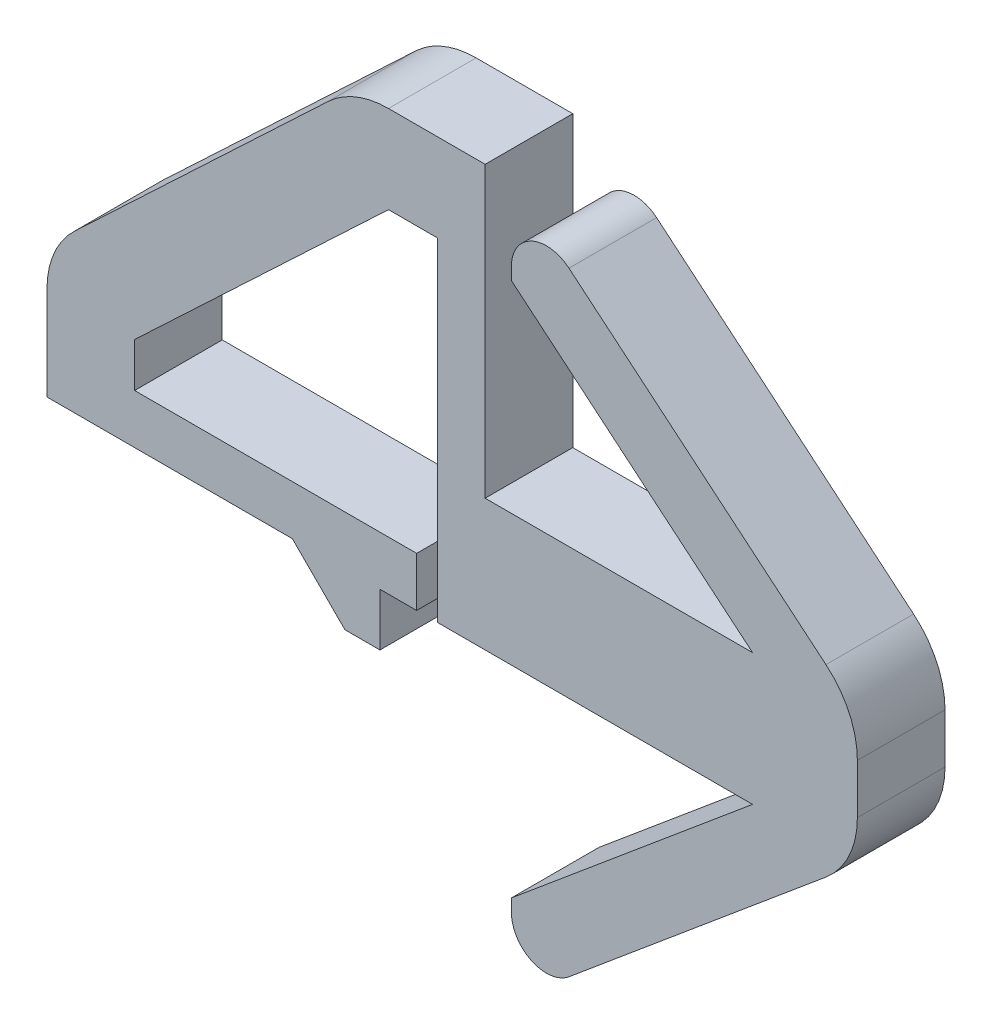
ISO-10303-21;
HEADER;
FILE_DESCRIPTION(('STEP AP214'),'2;1');
FILE_NAME('part.step','',(''),(''),'','','');
FILE_SCHEMA(('AUTOMOTIVE_DESIGN { 1 0 10303 214 1 1 1 1 }'));
ENDSEC;
DATA;
#1=APPLICATION_CONTEXT('core data for automotive mechanical design processes');
#2=APPLICATION_PROTOCOL_DEFINITION('international standard','automotive_design',2000,#1);
#3=PRODUCT_CONTEXT('',#1,'mechanical');
#4=PRODUCT('Part','Part','',(#3));
#5=PRODUCT_RELATED_PRODUCT_CATEGORY('part','',(#4));
#6=PRODUCT_DEFINITION_FORMATION('','',#4);
#7=PRODUCT_DEFINITION_CONTEXT('part definition',#1,'design');
#8=PRODUCT_DEFINITION('design','',#6,#7);
#9=PRODUCT_DEFINITION_SHAPE('','',#8);
#10=(LENGTH_UNIT() NAMED_UNIT(*) SI_UNIT(.MILLI.,.METRE.));
#11=(NAMED_UNIT(*) PLANE_ANGLE_UNIT() SI_UNIT($,.RADIAN.));
#12=(NAMED_UNIT(*) SI_UNIT($,.STERADIAN.) SOLID_ANGLE_UNIT());
#13=UNCERTAINTY_MEASURE_WITH_UNIT(LENGTH_MEASURE(1.E-05),#10,'distance_accuracy_value','');
#14=(GEOMETRIC_REPRESENTATION_CONTEXT(3) GLOBAL_UNCERTAINTY_ASSIGNED_CONTEXT((#13)) GLOBAL_UNIT_ASSIGNED_CONTEXT((#10,
#11,#12)) REPRESENTATION_CONTEXT('',''));
#15=CARTESIAN_POINT('',(0.,0.,0.));
#16=DIRECTION('',(0.,0.,1.));
#17=DIRECTION('',(1.,0.,0.));
#18=AXIS2_PLACEMENT_3D('',#15,#16,#17);
#19=CARTESIAN_POINT('',(-2.7,-0.148693319501588,2.));
#20=DIRECTION('',(0.,1.,0.));
#21=DIRECTION('',(-1.,0.,0.));
#22=AXIS2_PLACEMENT_3D('',#19,#20,#21);
#23=PLANE('',#22);
#24=DIRECTION('',(1.,0.,0.));
#25=VECTOR('',#24,1.);
#26=CARTESIAN_POINT('',(-2.7,-0.148693319501588,2.));
#27=LINE('',#26,#25);
#28=CARTESIAN_POINT('',(-1.38313932474897,-0.148693319501588,2.));
#29=VERTEX_POINT('',#28);
#30=CARTESIAN_POINT('',(5.80285787318373,-0.148693319501588,2.));
#31=VERTEX_POINT('',#30);
#32=EDGE_CURVE('E310',#29,#31,#27,.T.);
#33=ORIENTED_EDGE('',*,*,#32,.F.);
#34=DIRECTION('',(0.,0.,1.));
#35=VECTOR('',#34,1.);
#36=CARTESIAN_POINT('',(-1.38313932474897,-0.148693319501588,0.));
#37=LINE('',#36,#35);
#38=CARTESIAN_POINT('',(-1.38313932474897,-0.148693319501588,0.));
#39=VERTEX_POINT('',#38);
#40=EDGE_CURVE('E289',#39,#29,#37,.T.);
#41=ORIENTED_EDGE('',*,*,#40,.F.);
#42=DIRECTION('',(1.,0.,0.));
#43=VECTOR('',#42,1.);
#44=CARTESIAN_POINT('',(-2.7,-0.148693319501588,0.));
#45=LINE('',#44,#43);
#46=CARTESIAN_POINT('',(5.80285787318373,-0.148693319501588,0.));
#47=VERTEX_POINT('',#46);
#48=EDGE_CURVE('E351',#39,#47,#45,.T.);
#49=ORIENTED_EDGE('',*,*,#48,.T.);
#50=DIRECTION('',(0.,0.,-1.));
#51=VECTOR('',#50,1.);
#52=CARTESIAN_POINT('',(5.80285787318373,-0.148693319501588,2.));
#53=LINE('',#52,#51);
#54=EDGE_CURVE('E395',#31,#47,#53,.T.);
#55=ORIENTED_EDGE('',*,*,#54,.F.);
#56=EDGE_LOOP('',(#33,#41,#49,#55));
#57=FACE_BOUND('',#56,.T.);
#58=ADVANCED_FACE('F39',(#57),#23,.F.);
#59=CARTESIAN_POINT('',(-10.3,-0.148693319501588,2.));
#60=DIRECTION('',(1.,0.,0.));
#61=DIRECTION('',(0.,0.,-1.));
#62=AXIS2_PLACEMENT_3D('',#59,#60,#61);
#63=PLANE('',#62);
#64=DIRECTION('',(0.,-1.,0.));
#65=VECTOR('',#64,1.);
#66=CARTESIAN_POINT('',(-10.3,-0.148693319501588,2.));
#67=LINE('',#66,#65);
#68=CARTESIAN_POINT('',(-10.3,1.9882178871714,2.));
#69=VERTEX_POINT('',#68);
#70=CARTESIAN_POINT('',(-10.3,-0.148693319501588,2.));
#71=VERTEX_POINT('',#70);
#72=EDGE_CURVE('E300',#69,#71,#67,.T.);
#73=ORIENTED_EDGE('',*,*,#72,.F.);
#74=DIRECTION('',(0.,0.,-1.));
#75=VECTOR('',#74,1.);
#76=CARTESIAN_POINT('',(-10.3,1.9882178871714,2.));
#77=LINE('',#76,#75);
#78=CARTESIAN_POINT('',(-10.3,1.9882178871714,0.));
#79=VERTEX_POINT('',#78);
#80=EDGE_CURVE('E455',#69,#79,#77,.T.);
#81=ORIENTED_EDGE('',*,*,#80,.T.);
#82=DIRECTION('',(0.,-1.,0.));
#83=VECTOR('',#82,1.);
#84=CARTESIAN_POINT('',(-10.3,-0.148693319501588,0.));
#85=LINE('',#84,#83);
#86=CARTESIAN_POINT('',(-10.3,-0.148693319501588,0.));
#87=VERTEX_POINT('',#86);
#88=EDGE_CURVE('E288',#79,#87,#85,.T.);
#89=ORIENTED_EDGE('',*,*,#88,.T.);
#90=DIRECTION('',(0.,0.,-1.));
#91=VECTOR('',#90,1.);
#92=CARTESIAN_POINT('',(-10.3,-0.148693319501588,2.));
#93=LINE('',#92,#91);
#94=EDGE_CURVE('E406',#71,#87,#93,.T.);
#95=ORIENTED_EDGE('',*,*,#94,.F.);
#96=EDGE_LOOP('',(#73,#81,#89,#95));
#97=FACE_BOUND('',#96,.T.);
#98=ADVANCED_FACE('F506',(#97),#63,.F.);
#99=CARTESIAN_POINT('',(-10.3,-0.148693319501588,2.));
#100=DIRECTION('',(0.,1.,0.));
#101=DIRECTION('',(0.,0.,1.));
#102=AXIS2_PLACEMENT_3D('',#99,#100,#101);
#103=PLANE('',#102);
#104=DIRECTION('',(1.,0.,0.));
#105=VECTOR('',#104,1.);
#106=CARTESIAN_POINT('',(-10.3,-0.148693319501588,0.));
#107=LINE('',#106,#105);
#108=CARTESIAN_POINT('',(-4.7,-0.148693319501588,0.));
#109=VERTEX_POINT('',#108);
#110=EDGE_CURVE('E343',#87,#109,#107,.T.);
#111=ORIENTED_EDGE('',*,*,#110,.T.);
#112=DIRECTION('',(0.,0.,-1.));
#113=VECTOR('',#112,1.);
#114=CARTESIAN_POINT('',(-4.7,-0.148693319501588,2.));
#115=LINE('',#114,#113);
#116=CARTESIAN_POINT('',(-4.7,-0.148693319501588,2.));
#117=VERTEX_POINT('',#116);
#118=EDGE_CURVE('E404',#117,#109,#115,.T.);
#119=ORIENTED_EDGE('',*,*,#118,.F.);
#120=DIRECTION('',(1.,0.,0.));
#121=VECTOR('',#120,1.);
#122=CARTESIAN_POINT('',(-10.3,-0.148693319501588,2.));
#123=LINE('',#122,#121);
#124=EDGE_CURVE('E302',#71,#117,#123,.T.);
#125=ORIENTED_EDGE('',*,*,#124,.F.);
#126=ORIENTED_EDGE('',*,*,#94,.T.);
#127=EDGE_LOOP('',(#111,#119,#125,#126));
#128=FACE_BOUND('',#127,.T.);
#129=ADVANCED_FACE('F471',(#128),#103,.F.);
#130=CARTESIAN_POINT('',(-4.7,-1.34869331950159,2.));
#131=DIRECTION('',(0.,1.,0.));
#132=DIRECTION('',(-1.,0.,0.));
#133=AXIS2_PLACEMENT_3D('',#130,#131,#132);
#134=PLANE('',#133);
#135=DIRECTION('',(1.,0.,0.));
#136=VECTOR('',#135,1.);
#137=CARTESIAN_POINT('',(-4.7,-1.34869331950159,2.));
#138=LINE('',#137,#136);
#139=CARTESIAN_POINT('',(-3.5,-1.34869331950159,2.));
#140=VERTEX_POINT('',#139);
#141=CARTESIAN_POINT('',(-2.7,-1.34869331950159,2.));
#142=VERTEX_POINT('',#141);
#143=EDGE_CURVE('E306',#140,#142,#138,.T.);
#144=ORIENTED_EDGE('',*,*,#143,.F.);
#145=DIRECTION('',(0.,0.,-1.));
#146=VECTOR('',#145,1.);
#147=CARTESIAN_POINT('',(-3.5,-1.34869331950159,2.));
#148=LINE('',#147,#146);
#149=CARTESIAN_POINT('',(-3.5,-1.34869331950159,0.));
#150=VERTEX_POINT('',#149);
#151=EDGE_CURVE('E465',#140,#150,#148,.T.);
#152=ORIENTED_EDGE('',*,*,#151,.T.);
#153=DIRECTION('',(1.,0.,0.));
#154=VECTOR('',#153,1.);
#155=CARTESIAN_POINT('',(-4.7,-1.34869331950159,0.));
#156=LINE('',#155,#154);
#157=CARTESIAN_POINT('',(-2.7,-1.34869331950159,0.));
#158=VERTEX_POINT('',#157);
#159=EDGE_CURVE('E347',#150,#158,#156,.T.);
#160=ORIENTED_EDGE('',*,*,#159,.T.);
#161=DIRECTION('',(0.,0.,-1.));
#162=VECTOR('',#161,1.);
#163=CARTESIAN_POINT('',(-2.7,-1.34869331950159,2.));
#164=LINE('',#163,#162);
#165=EDGE_CURVE('E401',#142,#158,#164,.T.);
#166=ORIENTED_EDGE('',*,*,#165,.F.);
#167=EDGE_LOOP('',(#144,#152,#160,#166));
#168=FACE_BOUND('',#167,.T.);
#169=ADVANCED_FACE('F475',(#168),#134,.F.);
#170=CARTESIAN_POINT('',(-2.7,-0.148693319501588,2.));
#171=DIRECTION('',(-1.,0.,0.));
#172=DIRECTION('',(0.,0.,1.));
#173=AXIS2_PLACEMENT_3D('',#170,#171,#172);
#174=PLANE('',#173);
#175=DIRECTION('',(0.,1.,0.));
#176=VECTOR('',#175,1.);
#177=CARTESIAN_POINT('',(-2.7,-0.148693319501588,0.));
#178=LINE('',#177,#176);
#179=CARTESIAN_POINT('',(-2.7,-0.148693319501588,0.));
#180=VERTEX_POINT('',#179);
#181=EDGE_CURVE('E349',#158,#180,#178,.T.);
#182=ORIENTED_EDGE('',*,*,#181,.T.);
#183=DIRECTION('',(0.,0.,-1.));
#184=VECTOR('',#183,1.);
#185=CARTESIAN_POINT('',(-2.7,-0.148693319501588,2.));
#186=LINE('',#185,#184);
#187=CARTESIAN_POINT('',(-2.7,-0.148693319501588,2.));
#188=VERTEX_POINT('',#187);
#189=EDGE_CURVE('E398',#188,#180,#186,.T.);
#190=ORIENTED_EDGE('',*,*,#189,.F.);
#191=DIRECTION('',(0.,1.,0.));
#192=VECTOR('',#191,1.);
#193=CARTESIAN_POINT('',(-2.7,-0.148693319501588,2.));
#194=LINE('',#193,#192);
#195=EDGE_CURVE('E308',#142,#188,#194,.T.);
#196=ORIENTED_EDGE('',*,*,#195,.F.);
#197=ORIENTED_EDGE('',*,*,#165,.T.);
#198=EDGE_LOOP('',(#182,#190,#196,#197));
#199=FACE_BOUND('',#198,.T.);
#200=ADVANCED_FACE('F483',(#199),#174,.F.);
#201=CARTESIAN_POINT('',(-1.86344201079392,-0.148693319501588,0.));
#202=VERTEX_POINT('',#201);
#203=EDGE_CURVE('E352',#180,#202,#45,.T.);
#204=ORIENTED_EDGE('',*,*,#203,.T.);
#205=DIRECTION('',(0.,0.,1.));
#206=VECTOR('',#205,1.);
#207=CARTESIAN_POINT('',(-1.86344201079392,-0.148693319501588,0.));
#208=LINE('',#207,#206);
#209=CARTESIAN_POINT('',(-1.86344201079392,-0.148693319501588,2.));
#210=VERTEX_POINT('',#209);
#211=EDGE_CURVE('E291',#202,#210,#208,.T.);
#212=ORIENTED_EDGE('',*,*,#211,.T.);
#213=EDGE_CURVE('E311',#188,#210,#27,.T.);
#214=ORIENTED_EDGE('',*,*,#213,.F.);
#215=ORIENTED_EDGE('',*,*,#189,.T.);
#216=EDGE_LOOP('',(#204,#212,#214,#215));
#217=FACE_BOUND('',#216,.T.);
#218=ADVANCED_FACE('F486',(#217),#23,.F.);
#219=CARTESIAN_POINT('',(0.3,-4.74869331950159,2.));
#220=DIRECTION('',(0.641359087792286,-0.767240849086026,0.));
#221=DIRECTION('',(0.767240849086026,0.641359087792286,0.));
#222=AXIS2_PLACEMENT_3D('',#219,#220,#221);
#223=PLANE('',#222);
#224=DIRECTION('',(-0.767240849086026,-0.641359087792286,0.));
#225=VECTOR('',#224,1.);
#226=CARTESIAN_POINT('',(0.3,-4.74869331950159,0.));
#227=LINE('',#226,#225);
#228=CARTESIAN_POINT('',(0.3,-4.74869331950159,0.));
#229=VERTEX_POINT('',#228);
#230=EDGE_CURVE('E355',#47,#229,#227,.T.);
#231=ORIENTED_EDGE('',*,*,#230,.T.);
#232=DIRECTION('',(0.,0.,-1.));
#233=VECTOR('',#232,1.);
#234=CARTESIAN_POINT('',(0.3,-4.74869331950159,2.));
#235=LINE('',#234,#233);
#236=CARTESIAN_POINT('',(0.3,-4.74869331950159,2.));
#237=VERTEX_POINT('',#236);
#238=EDGE_CURVE('E392',#237,#229,#235,.T.);
#239=ORIENTED_EDGE('',*,*,#238,.F.);
#240=DIRECTION('',(-0.767240849086026,-0.641359087792286,0.));
#241=VECTOR('',#240,1.);
#242=CARTESIAN_POINT('',(0.3,-4.74869331950159,2.));
#243=LINE('',#242,#241);
#244=EDGE_CURVE('E314',#31,#237,#243,.T.);
#245=ORIENTED_EDGE('',*,*,#244,.F.);
#246=ORIENTED_EDGE('',*,*,#54,.T.);
#247=EDGE_LOOP('',(#231,#239,#245,#246));
#248=FACE_BOUND('',#247,.T.);
#249=ADVANCED_FACE('F518',(#248),#223,.F.);
#250=CARTESIAN_POINT('',(0.3,-6.74869331950159,2.));
#251=DIRECTION('',(1.,0.,0.));
#252=DIRECTION('',(0.,0.,-1.));
#253=AXIS2_PLACEMENT_3D('',#250,#251,#252);
#254=PLANE('',#253);
#255=DIRECTION('',(0.,-1.,0.));
#256=VECTOR('',#255,1.);
#257=CARTESIAN_POINT('',(0.3,-6.74869331950159,0.));
#258=LINE('',#257,#256);
#259=CARTESIAN_POINT('',(0.3,-5.03725254859107,0.));
#260=VERTEX_POINT('',#259);
#261=EDGE_CURVE('E357',#229,#260,#258,.T.);
#262=ORIENTED_EDGE('',*,*,#261,.T.);
#263=DIRECTION('',(0.,0.,-1.));
#264=VECTOR('',#263,1.);
#265=CARTESIAN_POINT('',(0.3,-5.03725254859107,2.));
#266=LINE('',#265,#264);
#267=CARTESIAN_POINT('',(0.3,-5.03725254859107,2.));
#268=VERTEX_POINT('',#267);
#269=EDGE_CURVE('E417',#260,#268,#266,.F.);
#270=ORIENTED_EDGE('',*,*,#269,.T.);
#271=DIRECTION('',(0.,-1.,0.));
#272=VECTOR('',#271,1.);
#273=CARTESIAN_POINT('',(0.3,-6.74869331950159,2.));
#274=LINE('',#273,#272);
#275=EDGE_CURVE('E316',#237,#268,#274,.T.);
#276=ORIENTED_EDGE('',*,*,#275,.F.);
#277=ORIENTED_EDGE('',*,*,#238,.T.);
#278=EDGE_LOOP('',(#262,#270,#276,#277));
#279=FACE_BOUND('',#278,.T.);
#280=ADVANCED_FACE('F523',(#279),#254,.F.);
#281=CARTESIAN_POINT('',(8.19540477456796,-0.148693319501586,2.));
#282=DIRECTION('',(-0.641359087792287,0.767240849086026,0.));
#283=DIRECTION('',(-0.767240849086026,-0.641359087792287,0.));
#284=AXIS2_PLACEMENT_3D('',#281,#282,#283);
#285=PLANE('',#284);
#286=DIRECTION('',(0.767240849086026,0.641359087792287,0.));
#287=VECTOR('',#286,1.);
#288=CARTESIAN_POINT('',(8.19540477456796,-0.148693319501586,0.));
#289=LINE('',#288,#287);
#290=CARTESIAN_POINT('',(1.61308727023383,-5.65104522785989,0.));
#291=VERTEX_POINT('',#290);
#292=CARTESIAN_POINT('',(7.47812295015253,-0.748290195951896,0.));
#293=VERTEX_POINT('',#292);
#294=EDGE_CURVE('E360',#291,#293,#289,.T.);
#295=ORIENTED_EDGE('',*,*,#294,.T.);
#296=DIRECTION('',(0.,0.,-1.));
#297=VECTOR('',#296,1.);
#298=CARTESIAN_POINT('',(7.47812295015253,-0.748290195951896,2.));
#299=LINE('',#298,#297);
#300=CARTESIAN_POINT('',(7.47812295015253,-0.748290195951896,2.));
#301=VERTEX_POINT('',#300);
#302=EDGE_CURVE('E442',#293,#301,#299,.F.);
#303=ORIENTED_EDGE('',*,*,#302,.T.);
#304=DIRECTION('',(0.767240849086026,0.641359087792287,0.));
#305=VECTOR('',#304,1.);
#306=CARTESIAN_POINT('',(8.19540477456796,-0.148693319501586,2.));
#307=LINE('',#306,#305);
#308=CARTESIAN_POINT('',(1.61308727023383,-5.65104522785989,2.));
#309=VERTEX_POINT('',#308);
#310=EDGE_CURVE('E319',#309,#301,#307,.T.);
#311=ORIENTED_EDGE('',*,*,#310,.F.);
#312=DIRECTION('',(0.,0.,-1.));
#313=VECTOR('',#312,1.);
#314=CARTESIAN_POINT('',(1.61308727023383,-5.65104522785989,2.));
#315=LINE('',#314,#313);
#316=EDGE_CURVE('E409',#309,#291,#315,.T.);
#317=ORIENTED_EDGE('',*,*,#316,.T.);
#318=EDGE_LOOP('',(#295,#303,#311,#317));
#319=FACE_BOUND('',#318,.T.);
#320=ADVANCED_FACE('F613',(#319),#285,.F.);
#321=CARTESIAN_POINT('',(8.19540477456796,2.85130668049841,2.));
#322=DIRECTION('',(-1.,0.,0.));
#323=DIRECTION('',(0.,0.,1.));
#324=AXIS2_PLACEMENT_3D('',#321,#322,#323);
#325=PLANE('',#324);
#326=DIRECTION('',(0.,1.,0.));
#327=VECTOR('',#326,1.);
#328=CARTESIAN_POINT('',(8.19540477456796,2.85130668049841,2.));
#329=LINE('',#328,#327);
#330=CARTESIAN_POINT('',(8.19540477456796,0.786191502220156,2.));
#331=VERTEX_POINT('',#330);
#332=CARTESIAN_POINT('',(8.19540477456796,1.91642185877667,2.));
#333=VERTEX_POINT('',#332);
#334=EDGE_CURVE('E322',#331,#333,#329,.T.);
#335=ORIENTED_EDGE('',*,*,#334,.F.);
#336=DIRECTION('',(0.,0.,-1.));
#337=VECTOR('',#336,1.);
#338=CARTESIAN_POINT('',(8.19540477456796,0.786191502220156,2.));
#339=LINE('',#338,#337);
#340=CARTESIAN_POINT('',(8.19540477456796,0.786191502220156,0.));
#341=VERTEX_POINT('',#340);
#342=EDGE_CURVE('E431',#331,#341,#339,.T.);
#343=ORIENTED_EDGE('',*,*,#342,.T.);
#344=DIRECTION('',(0.,1.,0.));
#345=VECTOR('',#344,1.);
#346=CARTESIAN_POINT('',(8.19540477456796,2.85130668049841,0.));
#347=LINE('',#346,#345);
#348=CARTESIAN_POINT('',(8.19540477456796,1.91642185877667,0.));
#349=VERTEX_POINT('',#348);
#350=EDGE_CURVE('E363',#341,#349,#347,.T.);
#351=ORIENTED_EDGE('',*,*,#350,.T.);
#352=DIRECTION('',(0.,0.,-1.));
#353=VECTOR('',#352,1.);
#354=CARTESIAN_POINT('',(8.19540477456796,1.91642185877667,2.));
#355=LINE('',#354,#353);
#356=EDGE_CURVE('E429',#349,#333,#355,.F.);
#357=ORIENTED_EDGE('',*,*,#356,.T.);
#358=EDGE_LOOP('',(#335,#343,#351,#357));
#359=FACE_BOUND('',#358,.T.);
#360=ADVANCED_FACE('F607',(#359),#325,.F.);
#361=CARTESIAN_POINT('',(0.299999999999999,9.45130668049841,2.));
#362=DIRECTION('',(-0.641359087792287,-0.767240849086026,0.));
#363=DIRECTION('',(0.767240849086026,-0.641359087792287,0.));
#364=AXIS2_PLACEMENT_3D('',#361,#362,#363);
#365=PLANE('',#364);
#366=DIRECTION('',(-0.767240849086026,0.641359087792287,0.));
#367=VECTOR('',#366,1.);
#368=CARTESIAN_POINT('',(0.299999999999999,9.45130668049841,2.));
#369=LINE('',#368,#367);
#370=CARTESIAN_POINT('',(7.47812295015253,3.45090355694872,2.));
#371=VERTEX_POINT('',#370);
#372=CARTESIAN_POINT('',(1.61308727023383,8.35365858885672,2.));
#373=VERTEX_POINT('',#372);
#374=EDGE_CURVE('E325',#371,#373,#369,.T.);
#375=ORIENTED_EDGE('',*,*,#374,.F.);
#376=DIRECTION('',(0.,0.,-1.));
#377=VECTOR('',#376,1.);
#378=CARTESIAN_POINT('',(7.47812295015253,3.45090355694872,2.));
#379=LINE('',#378,#377);
#380=CARTESIAN_POINT('',(7.47812295015253,3.45090355694872,0.));
#381=VERTEX_POINT('',#380);
#382=EDGE_CURVE('E452',#371,#381,#379,.T.);
#383=ORIENTED_EDGE('',*,*,#382,.T.);
#384=DIRECTION('',(-0.767240849086026,0.641359087792287,0.));
#385=VECTOR('',#384,1.);
#386=CARTESIAN_POINT('',(0.299999999999999,9.45130668049841,0.));
#387=LINE('',#386,#385);
#388=CARTESIAN_POINT('',(1.61308727023383,8.35365858885672,0.));
#389=VERTEX_POINT('',#388);
#390=EDGE_CURVE('E366',#381,#389,#387,.T.);
#391=ORIENTED_EDGE('',*,*,#390,.T.);
#392=DIRECTION('',(0.,0.,-1.));
#393=VECTOR('',#392,1.);
#394=CARTESIAN_POINT('',(1.61308727023383,8.35365858885672,2.));
#395=LINE('',#394,#393);
#396=EDGE_CURVE('E426',#389,#373,#395,.F.);
#397=ORIENTED_EDGE('',*,*,#396,.T.);
#398=EDGE_LOOP('',(#375,#383,#391,#397));
#399=FACE_BOUND('',#398,.T.);
#400=ADVANCED_FACE('F600',(#399),#365,.F.);
#401=CARTESIAN_POINT('',(0.3,7.45130668049841,2.));
#402=DIRECTION('',(1.,0.,0.));
#403=DIRECTION('',(0.,1.,0.));
#404=AXIS2_PLACEMENT_3D('',#401,#402,#403);
#405=PLANE('',#404);
#406=DIRECTION('',(0.,-1.,0.));
#407=VECTOR('',#406,1.);
#408=CARTESIAN_POINT('',(0.3,7.45130668049841,2.));
#409=LINE('',#408,#407);
#410=CARTESIAN_POINT('',(0.3,7.73986590958789,2.));
#411=VERTEX_POINT('',#410);
#412=CARTESIAN_POINT('',(0.3,7.45130668049841,2.));
#413=VERTEX_POINT('',#412);
#414=EDGE_CURVE('E327',#411,#413,#409,.T.);
#415=ORIENTED_EDGE('',*,*,#414,.F.);
#416=DIRECTION('',(0.,0.,-1.));
#417=VECTOR('',#416,1.);
#418=CARTESIAN_POINT('',(0.3,7.73986590958789,2.));
#419=LINE('',#418,#417);
#420=CARTESIAN_POINT('',(0.3,7.73986590958789,0.));
#421=VERTEX_POINT('',#420);
#422=EDGE_CURVE('E423',#411,#421,#419,.T.);
#423=ORIENTED_EDGE('',*,*,#422,.T.);
#424=DIRECTION('',(0.,-1.,0.));
#425=VECTOR('',#424,1.);
#426=CARTESIAN_POINT('',(0.3,7.45130668049841,0.));
#427=LINE('',#426,#425);
#428=CARTESIAN_POINT('',(0.3,7.45130668049841,0.));
#429=VERTEX_POINT('',#428);
#430=EDGE_CURVE('E368',#421,#429,#427,.T.);
#431=ORIENTED_EDGE('',*,*,#430,.T.);
#432=DIRECTION('',(0.,0.,-1.));
#433=VECTOR('',#432,1.);
#434=CARTESIAN_POINT('',(0.3,7.45130668049841,2.));
#435=LINE('',#434,#433);
#436=EDGE_CURVE('E389',#413,#429,#435,.T.);
#437=ORIENTED_EDGE('',*,*,#436,.F.);
#438=EDGE_LOOP('',(#415,#423,#431,#437));
#439=FACE_BOUND('',#438,.T.);
#440=ADVANCED_FACE('F593',(#439),#405,.F.);
#441=CARTESIAN_POINT('',(5.80285787318373,2.85130668049841,2.));
#442=DIRECTION('',(0.641359087792287,0.767240849086026,0.));
#443=DIRECTION('',(-0.767240849086026,0.641359087792287,0.));
#444=AXIS2_PLACEMENT_3D('',#441,#442,#443);
#445=PLANE('',#444);
#446=DIRECTION('',(0.767240849086026,-0.641359087792287,0.));
#447=VECTOR('',#446,1.);
#448=CARTESIAN_POINT('',(5.80285787318373,2.85130668049841,0.));
#449=LINE('',#448,#447);
#450=CARTESIAN_POINT('',(5.80285787318373,2.85130668049841,0.));
#451=VERTEX_POINT('',#450);
#452=EDGE_CURVE('E370',#429,#451,#449,.T.);
#453=ORIENTED_EDGE('',*,*,#452,.T.);
#454=DIRECTION('',(0.,0.,-1.));
#455=VECTOR('',#454,1.);
#456=CARTESIAN_POINT('',(5.80285787318373,2.85130668049841,2.));
#457=LINE('',#456,#455);
#458=CARTESIAN_POINT('',(5.80285787318373,2.85130668049841,2.));
#459=VERTEX_POINT('',#458);
#460=EDGE_CURVE('E386',#459,#451,#457,.T.);
#461=ORIENTED_EDGE('',*,*,#460,.F.);
#462=DIRECTION('',(0.767240849086026,-0.641359087792287,0.));
#463=VECTOR('',#462,1.);
#464=CARTESIAN_POINT('',(5.80285787318373,2.85130668049841,2.));
#465=LINE('',#464,#463);
#466=EDGE_CURVE('E329',#413,#459,#465,.T.);
#467=ORIENTED_EDGE('',*,*,#466,.F.);
#468=ORIENTED_EDGE('',*,*,#436,.T.);
#469=EDGE_LOOP('',(#453,#461,#467,#468));
#470=FACE_BOUND('',#469,.T.);
#471=ADVANCED_FACE('F589',(#470),#445,.F.);
#472=CARTESIAN_POINT('',(-0.3,2.85130668049841,2.));
#473=DIRECTION('',(0.,-1.,0.));
#474=DIRECTION('',(0.,0.,-1.));
#475=AXIS2_PLACEMENT_3D('',#472,#473,#474);
#476=PLANE('',#475);
#477=DIRECTION('',(-1.,0.,0.));
#478=VECTOR('',#477,1.);
#479=CARTESIAN_POINT('',(-0.3,2.85130668049841,0.));
#480=LINE('',#479,#478);
#481=CARTESIAN_POINT('',(-0.3,2.85130668049841,0.));
#482=VERTEX_POINT('',#481);
#483=EDGE_CURVE('E372',#451,#482,#480,.T.);
#484=ORIENTED_EDGE('',*,*,#483,.T.);
#485=DIRECTION('',(0.,0.,-1.));
#486=VECTOR('',#485,1.);
#487=CARTESIAN_POINT('',(-0.3,2.85130668049841,2.));
#488=LINE('',#487,#486);
#489=CARTESIAN_POINT('',(-0.3,2.85130668049841,2.));
#490=VERTEX_POINT('',#489);
#491=EDGE_CURVE('E383',#490,#482,#488,.T.);
#492=ORIENTED_EDGE('',*,*,#491,.F.);
#493=DIRECTION('',(-1.,0.,0.));
#494=VECTOR('',#493,1.);
#495=CARTESIAN_POINT('',(-0.3,2.85130668049841,2.));
#496=LINE('',#495,#494);
#497=EDGE_CURVE('E331',#459,#490,#496,.T.);
#498=ORIENTED_EDGE('',*,*,#497,.F.);
#499=ORIENTED_EDGE('',*,*,#460,.T.);
#500=EDGE_LOOP('',(#484,#492,#498,#499));
#501=FACE_BOUND('',#500,.T.);
#502=ADVANCED_FACE('F584',(#501),#476,.F.);
#503=CARTESIAN_POINT('',(-0.3,2.85130668049841,2.));
#504=DIRECTION('',(-1.,0.,0.));
#505=DIRECTION('',(0.,-1.,0.));
#506=AXIS2_PLACEMENT_3D('',#503,#504,#505);
#507=PLANE('',#506);
#508=DIRECTION('',(0.,1.,0.));
#509=VECTOR('',#508,1.);
#510=CARTESIAN_POINT('',(-0.3,2.85130668049841,0.));
#511=LINE('',#510,#509);
#512=CARTESIAN_POINT('',(-0.3,9.45130668049841,0.));
#513=VERTEX_POINT('',#512);
#514=EDGE_CURVE('E374',#482,#513,#511,.T.);
#515=ORIENTED_EDGE('',*,*,#514,.T.);
#516=DIRECTION('',(0.,0.,-1.));
#517=VECTOR('',#516,1.);
#518=CARTESIAN_POINT('',(-0.3,9.45130668049841,2.));
#519=LINE('',#518,#517);
#520=CARTESIAN_POINT('',(-0.3,9.45130668049841,2.));
#521=VERTEX_POINT('',#520);
#522=EDGE_CURVE('E341',#521,#513,#519,.T.);
#523=ORIENTED_EDGE('',*,*,#522,.F.);
#524=DIRECTION('',(0.,1.,0.));
#525=VECTOR('',#524,1.);
#526=CARTESIAN_POINT('',(-0.3,2.85130668049841,2.));
#527=LINE('',#526,#525);
#528=EDGE_CURVE('E333',#490,#521,#527,.T.);
#529=ORIENTED_EDGE('',*,*,#528,.F.);
#530=ORIENTED_EDGE('',*,*,#491,.T.);
#531=EDGE_LOOP('',(#515,#523,#529,#530));
#532=FACE_BOUND('',#531,.T.);
#533=ADVANCED_FACE('F578',(#532),#507,.F.);
#534=CARTESIAN_POINT('',(-0.3,9.45130668049841,2.));
#535=DIRECTION('',(0.,-1.,0.));
#536=DIRECTION('',(0.,0.,-1.));
#537=AXIS2_PLACEMENT_3D('',#534,#535,#536);
#538=PLANE('',#537);
#539=DIRECTION('',(-1.,0.,0.));
#540=VECTOR('',#539,1.);
#541=CARTESIAN_POINT('',(-0.3,9.45130668049841,0.));
#542=LINE('',#541,#540);
#543=CARTESIAN_POINT('',(-2.50581491616832,9.45130668049841,0.));
#544=VERTEX_POINT('',#543);
#545=EDGE_CURVE('E376',#513,#544,#542,.T.);
#546=ORIENTED_EDGE('',*,*,#545,.T.);
#547=DIRECTION('',(0.,0.,-1.));
#548=VECTOR('',#547,1.);
#549=CARTESIAN_POINT('',(-2.50581491616832,9.45130668049841,2.));
#550=LINE('',#549,#548);
#551=CARTESIAN_POINT('',(-2.50581491616832,9.45130668049841,2.));
#552=VERTEX_POINT('',#551);
#553=EDGE_CURVE('E463',#544,#552,#550,.F.);
#554=ORIENTED_EDGE('',*,*,#553,.T.);
#555=DIRECTION('',(-1.,0.,0.));
#556=VECTOR('',#555,1.);
#557=CARTESIAN_POINT('',(-0.3,9.45130668049841,2.));
#558=LINE('',#557,#556);
#559=EDGE_CURVE('E335',#521,#552,#558,.T.);
#560=ORIENTED_EDGE('',*,*,#559,.F.);
#561=ORIENTED_EDGE('',*,*,#522,.T.);
#562=EDGE_LOOP('',(#546,#554,#560,#561));
#563=FACE_BOUND('',#562,.T.);
#564=ADVANCED_FACE('F574',(#563),#538,.F.);
#565=CARTESIAN_POINT('',(-3.3,9.45130668049841,2.));
#566=DIRECTION('',(0.686012868689002,-0.727589406185306,0.));
#567=DIRECTION('',(0.727589406185306,0.686012868689002,0.));
#568=AXIS2_PLACEMENT_3D('',#565,#566,#567);
#569=PLANE('',#568);
#570=DIRECTION('',(-0.727589406185306,-0.686012868689002,0.));
#571=VECTOR('',#570,1.);
#572=CARTESIAN_POINT('',(-3.3,9.45130668049841,0.));
#573=LINE('',#572,#571);
#574=CARTESIAN_POINT('',(-3.87784065354632,8.90648549286902,0.));
#575=VERTEX_POINT('',#574);
#576=CARTESIAN_POINT('',(-9.67202573737801,3.44339669954201,0.));
#577=VERTEX_POINT('',#576);
#578=EDGE_CURVE('E303',#575,#577,#573,.T.);
#579=ORIENTED_EDGE('',*,*,#578,.T.);
#580=DIRECTION('',(0.,0.,-1.));
#581=VECTOR('',#580,1.);
#582=CARTESIAN_POINT('',(-9.67202573737801,3.44339669954201,2.));
#583=LINE('',#582,#581);
#584=CARTESIAN_POINT('',(-9.67202573737801,3.44339669954201,2.));
#585=VERTEX_POINT('',#584);
#586=EDGE_CURVE('E461',#577,#585,#583,.F.);
#587=ORIENTED_EDGE('',*,*,#586,.T.);
#588=DIRECTION('',(-0.727589406185306,-0.686012868689002,0.));
#589=VECTOR('',#588,1.);
#590=CARTESIAN_POINT('',(-3.3,9.45130668049841,2.));
#591=LINE('',#590,#589);
#592=CARTESIAN_POINT('',(-3.87784065354632,8.90648549286902,2.));
#593=VERTEX_POINT('',#592);
#594=EDGE_CURVE('E338',#593,#585,#591,.T.);
#595=ORIENTED_EDGE('',*,*,#594,.F.);
#596=DIRECTION('',(0.,0.,-1.));
#597=VECTOR('',#596,1.);
#598=CARTESIAN_POINT('',(-3.87784065354632,8.90648549286902,2.));
#599=LINE('',#598,#597);
#600=EDGE_CURVE('E458',#593,#575,#599,.T.);
#601=ORIENTED_EDGE('',*,*,#600,.T.);
#602=EDGE_LOOP('',(#579,#587,#595,#601));
#603=FACE_BOUND('',#602,.T.);
#604=ADVANCED_FACE('F566',(#603),#569,.F.);
#605=CARTESIAN_POINT('',(0.,0.,2.));
#606=DIRECTION('',(0.,0.,1.));
#607=DIRECTION('',(1.,0.,0.));
#608=AXIS2_PLACEMENT_3D('',#605,#606,#607);
#609=PLANE('',#608);
#610=ORIENTED_EDGE('',*,*,#124,.T.);
#611=DIRECTION('',(-0.707106781186546,0.70710678118655,0.));
#612=VECTOR('',#611,1.);
#613=CARTESIAN_POINT('',(-2.4243466597508,-2.42434665975079,2.));
#614=LINE('',#613,#612);
#615=EDGE_CURVE('E11',#117,#140,#614,.F.);
#616=ORIENTED_EDGE('',*,*,#615,.T.);
#617=ORIENTED_EDGE('',*,*,#143,.T.);
#618=ORIENTED_EDGE('',*,*,#195,.T.);
#619=ORIENTED_EDGE('',*,*,#213,.T.);
#620=DIRECTION('',(0.,-1.,0.));
#621=VECTOR('',#620,1.);
#622=CARTESIAN_POINT('',(-1.86344201079392,0.979922785871317,2.));
#623=LINE('',#622,#621);
#624=CARTESIAN_POINT('',(-1.86344201079392,0.979922785871317,2.));
#625=VERTEX_POINT('',#624);
#626=EDGE_CURVE('E263',#625,#210,#623,.T.);
#627=ORIENTED_EDGE('',*,*,#626,.F.);
#628=DIRECTION('',(1.,0.,0.));
#629=VECTOR('',#628,1.);
#630=CARTESIAN_POINT('',(-1.86344201079392,0.979922785871317,2.));
#631=LINE('',#630,#629);
#632=CARTESIAN_POINT('',(-8.3,0.979922785871316,2.));
#633=VERTEX_POINT('',#632);
#634=EDGE_CURVE('E282',#633,#625,#631,.T.);
#635=ORIENTED_EDGE('',*,*,#634,.F.);
#636=DIRECTION('',(0.,-1.,0.));
#637=VECTOR('',#636,1.);
#638=CARTESIAN_POINT('',(-8.3,0.979922785871316,2.));
#639=LINE('',#638,#637);
#640=CARTESIAN_POINT('',(-8.3,1.9882178871714,2.));
#641=VERTEX_POINT('',#640);
#642=EDGE_CURVE('E279',#641,#633,#639,.T.);
#643=ORIENTED_EDGE('',*,*,#642,.F.);
#644=DIRECTION('',(-0.727589406185306,-0.686012868689002,0.));
#645=VECTOR('',#644,1.);
#646=CARTESIAN_POINT('',(-8.3,1.9882178871714,2.));
#647=LINE('',#646,#645);
#648=CARTESIAN_POINT('',(-2.50581491616832,7.45130668049841,2.));
#649=VERTEX_POINT('',#648);
#650=EDGE_CURVE('E277',#649,#641,#647,.T.);
#651=ORIENTED_EDGE('',*,*,#650,.F.);
#652=DIRECTION('',(-1.,0.,0.));
#653=VECTOR('',#652,1.);
#654=CARTESIAN_POINT('',(-2.50581491616832,7.45130668049841,2.));
#655=LINE('',#654,#653);
#656=CARTESIAN_POINT('',(-1.38313932474897,7.45130668049841,2.));
#657=VERTEX_POINT('',#656);
#658=EDGE_CURVE('E242',#657,#649,#655,.T.);
#659=ORIENTED_EDGE('',*,*,#658,.F.);
#660=DIRECTION('',(0.,1.,0.));
#661=VECTOR('',#660,1.);
#662=CARTESIAN_POINT('',(-1.38313932474897,7.45130668049841,2.));
#663=LINE('',#662,#661);
#664=EDGE_CURVE('E260',#29,#657,#663,.T.);
#665=ORIENTED_EDGE('',*,*,#664,.F.);
#666=ORIENTED_EDGE('',*,*,#32,.T.);
#667=ORIENTED_EDGE('',*,*,#244,.T.);
#668=ORIENTED_EDGE('',*,*,#275,.T.);
#669=CARTESIAN_POINT('',(1.1,-5.03725254859107,2.));
#670=DIRECTION('',(0.,0.,1.));
#671=DIRECTION('',(1.,0.,0.));
#672=AXIS2_PLACEMENT_3D('',#669,#670,#671);
#673=CIRCLE('',#672,0.8);
#674=EDGE_CURVE('E421',#268,#309,#673,.T.);
#675=ORIENTED_EDGE('',*,*,#674,.T.);
#676=ORIENTED_EDGE('',*,*,#310,.T.);
#677=CARTESIAN_POINT('',(6.19540477456796,0.786191502220156,2.));
#678=DIRECTION('',(0.,0.,1.));
#679=DIRECTION('',(1.,0.,0.));
#680=AXIS2_PLACEMENT_3D('',#677,#678,#679);
#681=CIRCLE('',#680,2.);
#682=EDGE_CURVE('E450',#301,#331,#681,.T.);
#683=ORIENTED_EDGE('',*,*,#682,.T.);
#684=ORIENTED_EDGE('',*,*,#334,.T.);
#685=CARTESIAN_POINT('',(6.19540477456796,1.91642185877667,2.));
#686=DIRECTION('',(0.,0.,1.));
#687=DIRECTION('',(1.,0.,0.));
#688=AXIS2_PLACEMENT_3D('',#685,#686,#687);
#689=CIRCLE('',#688,2.);
#690=EDGE_CURVE('E448',#333,#371,#689,.T.);
#691=ORIENTED_EDGE('',*,*,#690,.T.);
#692=ORIENTED_EDGE('',*,*,#374,.T.);
#693=CARTESIAN_POINT('',(1.1,7.73986590958789,2.));
#694=DIRECTION('',(0.,0.,1.));
#695=DIRECTION('',(1.,0.,0.));
#696=AXIS2_PLACEMENT_3D('',#693,#694,#695);
#697=CIRCLE('',#696,0.8);
#698=EDGE_CURVE('E419',#373,#411,#697,.T.);
#699=ORIENTED_EDGE('',*,*,#698,.T.);
#700=ORIENTED_EDGE('',*,*,#414,.T.);
#701=ORIENTED_EDGE('',*,*,#466,.T.);
#702=ORIENTED_EDGE('',*,*,#497,.T.);
#703=ORIENTED_EDGE('',*,*,#528,.T.);
#704=ORIENTED_EDGE('',*,*,#559,.T.);
#705=CARTESIAN_POINT('',(-2.50581491616832,7.45130668049841,2.));
#706=DIRECTION('',(0.,0.,1.));
#707=DIRECTION('',(1.,0.,0.));
#708=AXIS2_PLACEMENT_3D('',#705,#706,#707);
#709=CIRCLE('',#708,2.);
#710=EDGE_CURVE('E444',#552,#593,#709,.T.);
#711=ORIENTED_EDGE('',*,*,#710,.T.);
#712=ORIENTED_EDGE('',*,*,#594,.T.);
#713=CARTESIAN_POINT('',(-8.3,1.9882178871714,2.));
#714=DIRECTION('',(0.,0.,1.));
#715=DIRECTION('',(1.,0.,0.));
#716=AXIS2_PLACEMENT_3D('',#713,#714,#715);
#717=CIRCLE('',#716,2.);
#718=EDGE_CURVE('E446',#585,#69,#717,.T.);
#719=ORIENTED_EDGE('',*,*,#718,.T.);
#720=ORIENTED_EDGE('',*,*,#72,.T.);
#721=EDGE_LOOP('',(#610,#616,#617,#618,#619,#627,#635,#643,#651,#659,#665,#666,#667,#668,#675,
#676,#683,#684,#691,#692,#699,#700,#701,#702,#703,#704,#711,#712,#719,#720));
#722=FACE_BOUND('',#721,.T.);
#723=ADVANCED_FACE('F478',(#722),#609,.T.);
#724=CARTESIAN_POINT('',(0.,0.,0.));
#725=DIRECTION('',(0.,0.,1.));
#726=DIRECTION('',(1.,0.,0.));
#727=AXIS2_PLACEMENT_3D('',#724,#725,#726);
#728=PLANE('',#727);
#729=ORIENTED_EDGE('',*,*,#159,.F.);
#730=DIRECTION('',(0.707106781186546,-0.70710678118655,0.));
#731=VECTOR('',#730,1.);
#732=CARTESIAN_POINT('',(-3.5,-1.34869331950159,0.));
#733=LINE('',#732,#731);
#734=EDGE_CURVE('E47',#150,#109,#733,.F.);
#735=ORIENTED_EDGE('',*,*,#734,.T.);
#736=ORIENTED_EDGE('',*,*,#110,.F.);
#737=ORIENTED_EDGE('',*,*,#88,.F.);
#738=CARTESIAN_POINT('',(-8.3,1.9882178871714,0.));
#739=DIRECTION('',(0.,0.,1.));
#740=DIRECTION('',(1.,0.,0.));
#741=AXIS2_PLACEMENT_3D('',#738,#739,#740);
#742=CIRCLE('',#741,2.);
#743=EDGE_CURVE('E436',#79,#577,#742,.F.);
#744=ORIENTED_EDGE('',*,*,#743,.T.);
#745=ORIENTED_EDGE('',*,*,#578,.F.);
#746=CARTESIAN_POINT('',(-2.50581491616832,7.45130668049841,0.));
#747=DIRECTION('',(0.,0.,1.));
#748=DIRECTION('',(1.,0.,0.));
#749=AXIS2_PLACEMENT_3D('',#746,#747,#748);
#750=CIRCLE('',#749,2.);
#751=EDGE_CURVE('E434',#575,#544,#750,.F.);
#752=ORIENTED_EDGE('',*,*,#751,.T.);
#753=ORIENTED_EDGE('',*,*,#545,.F.);
#754=ORIENTED_EDGE('',*,*,#514,.F.);
#755=ORIENTED_EDGE('',*,*,#483,.F.);
#756=ORIENTED_EDGE('',*,*,#452,.F.);
#757=ORIENTED_EDGE('',*,*,#430,.F.);
#758=CARTESIAN_POINT('',(1.1,7.73986590958789,0.));
#759=DIRECTION('',(0.,0.,1.));
#760=DIRECTION('',(1.,0.,0.));
#761=AXIS2_PLACEMENT_3D('',#758,#759,#760);
#762=CIRCLE('',#761,0.8);
#763=EDGE_CURVE('E412',#421,#389,#762,.F.);
#764=ORIENTED_EDGE('',*,*,#763,.T.);
#765=ORIENTED_EDGE('',*,*,#390,.F.);
#766=CARTESIAN_POINT('',(6.19540477456796,1.91642185877667,0.));
#767=DIRECTION('',(0.,0.,1.));
#768=DIRECTION('',(1.,0.,0.));
#769=AXIS2_PLACEMENT_3D('',#766,#767,#768);
#770=CIRCLE('',#769,2.);
#771=EDGE_CURVE('E438',#381,#349,#770,.F.);
#772=ORIENTED_EDGE('',*,*,#771,.T.);
#773=ORIENTED_EDGE('',*,*,#350,.F.);
#774=CARTESIAN_POINT('',(6.19540477456796,0.786191502220156,0.));
#775=DIRECTION('',(0.,0.,1.));
#776=DIRECTION('',(1.,0.,0.));
#777=AXIS2_PLACEMENT_3D('',#774,#775,#776);
#778=CIRCLE('',#777,2.);
#779=EDGE_CURVE('E440',#341,#293,#778,.F.);
#780=ORIENTED_EDGE('',*,*,#779,.T.);
#781=ORIENTED_EDGE('',*,*,#294,.F.);
#782=CARTESIAN_POINT('',(1.1,-5.03725254859107,0.));
#783=DIRECTION('',(0.,0.,1.));
#784=DIRECTION('',(1.,0.,0.));
#785=AXIS2_PLACEMENT_3D('',#782,#783,#784);
#786=CIRCLE('',#785,0.8);
#787=EDGE_CURVE('E415',#291,#260,#786,.F.);
#788=ORIENTED_EDGE('',*,*,#787,.T.);
#789=ORIENTED_EDGE('',*,*,#261,.F.);
#790=ORIENTED_EDGE('',*,*,#230,.F.);
#791=ORIENTED_EDGE('',*,*,#48,.F.);
#792=DIRECTION('',(0.,1.,0.));
#793=VECTOR('',#792,1.);
#794=CARTESIAN_POINT('',(-1.38313932474897,7.45130668049841,0.));
#795=LINE('',#794,#793);
#796=CARTESIAN_POINT('',(-1.38313932474897,7.45130668049841,0.));
#797=VERTEX_POINT('',#796);
#798=EDGE_CURVE('E247',#39,#797,#795,.T.);
#799=ORIENTED_EDGE('',*,*,#798,.T.);
#800=DIRECTION('',(-1.,0.,0.));
#801=VECTOR('',#800,1.);
#802=CARTESIAN_POINT('',(-2.50581491616832,7.45130668049841,0.));
#803=LINE('',#802,#801);
#804=CARTESIAN_POINT('',(-2.50581491616832,7.45130668049841,0.));
#805=VERTEX_POINT('',#804);
#806=EDGE_CURVE('E239',#797,#805,#803,.T.);
#807=ORIENTED_EDGE('',*,*,#806,.T.);
#808=DIRECTION('',(-0.727589406185306,-0.686012868689002,0.));
#809=VECTOR('',#808,1.);
#810=CARTESIAN_POINT('',(-8.3,1.9882178871714,0.));
#811=LINE('',#810,#809);
#812=CARTESIAN_POINT('',(-8.3,1.9882178871714,0.));
#813=VERTEX_POINT('',#812);
#814=EDGE_CURVE('E251',#805,#813,#811,.T.);
#815=ORIENTED_EDGE('',*,*,#814,.T.);
#816=DIRECTION('',(0.,-1.,0.));
#817=VECTOR('',#816,1.);
#818=CARTESIAN_POINT('',(-8.3,0.979922785871316,0.));
#819=LINE('',#818,#817);
#820=CARTESIAN_POINT('',(-8.3,0.979922785871316,0.));
#821=VERTEX_POINT('',#820);
#822=EDGE_CURVE('E255',#813,#821,#819,.T.);
#823=ORIENTED_EDGE('',*,*,#822,.T.);
#824=DIRECTION('',(1.,0.,0.));
#825=VECTOR('',#824,1.);
#826=CARTESIAN_POINT('',(-1.86344201079392,0.979922785871317,0.));
#827=LINE('',#826,#825);
#828=CARTESIAN_POINT('',(-1.86344201079392,0.979922785871317,0.));
#829=VERTEX_POINT('',#828);
#830=EDGE_CURVE('E268',#821,#829,#827,.T.);
#831=ORIENTED_EDGE('',*,*,#830,.T.);
#832=DIRECTION('',(0.,-1.,0.));
#833=VECTOR('',#832,1.);
#834=CARTESIAN_POINT('',(-1.86344201079392,0.979922785871317,0.));
#835=LINE('',#834,#833);
#836=EDGE_CURVE('E272',#829,#202,#835,.T.);
#837=ORIENTED_EDGE('',*,*,#836,.T.);
#838=ORIENTED_EDGE('',*,*,#203,.F.);
#839=ORIENTED_EDGE('',*,*,#181,.F.);
#840=EDGE_LOOP('',(#729,#735,#736,#737,#744,#745,#752,#753,#754,#755,#756,#757,#764,#765,#772,
#773,#780,#781,#788,#789,#790,#791,#799,#807,#815,#823,#831,#837,#838,#839));
#841=FACE_BOUND('',#840,.T.);
#842=ADVANCED_FACE('F258',(#841),#728,.F.);
#843=CARTESIAN_POINT('',(1.1,-5.03725254859107,2.));
#844=DIRECTION('',(0.,0.,-1.));
#845=DIRECTION('',(-1.,0.,0.));
#846=AXIS2_PLACEMENT_3D('',#843,#844,#845);
#847=CYLINDRICAL_SURFACE('',#846,0.8);
#848=ORIENTED_EDGE('',*,*,#674,.F.);
#849=ORIENTED_EDGE('',*,*,#269,.F.);
#850=ORIENTED_EDGE('',*,*,#787,.F.);
#851=ORIENTED_EDGE('',*,*,#316,.F.);
#852=EDGE_LOOP('',(#848,#849,#850,#851));
#853=FACE_BOUND('',#852,.T.);
#854=ADVANCED_FACE('F532',(#853),#847,.T.);
#855=CARTESIAN_POINT('',(1.1,7.73986590958789,2.));
#856=DIRECTION('',(0.,0.,-1.));
#857=DIRECTION('',(-1.,0.,0.));
#858=AXIS2_PLACEMENT_3D('',#855,#856,#857);
#859=CYLINDRICAL_SURFACE('',#858,0.8);
#860=ORIENTED_EDGE('',*,*,#698,.F.);
#861=ORIENTED_EDGE('',*,*,#396,.F.);
#862=ORIENTED_EDGE('',*,*,#763,.F.);
#863=ORIENTED_EDGE('',*,*,#422,.F.);
#864=EDGE_LOOP('',(#860,#861,#862,#863));
#865=FACE_BOUND('',#864,.T.);
#866=ADVANCED_FACE('F535',(#865),#859,.T.);
#867=CARTESIAN_POINT('',(6.19540477456796,0.786191502220156,2.));
#868=DIRECTION('',(0.,0.,-1.));
#869=DIRECTION('',(-1.,0.,0.));
#870=AXIS2_PLACEMENT_3D('',#867,#868,#869);
#871=CYLINDRICAL_SURFACE('',#870,2.);
#872=ORIENTED_EDGE('',*,*,#682,.F.);
#873=ORIENTED_EDGE('',*,*,#302,.F.);
#874=ORIENTED_EDGE('',*,*,#779,.F.);
#875=ORIENTED_EDGE('',*,*,#342,.F.);
#876=EDGE_LOOP('',(#872,#873,#874,#875));
#877=FACE_BOUND('',#876,.T.);
#878=ADVANCED_FACE('F539',(#877),#871,.T.);
#879=CARTESIAN_POINT('',(6.19540477456796,1.91642185877667,2.));
#880=DIRECTION('',(0.,0.,-1.));
#881=DIRECTION('',(-1.,0.,0.));
#882=AXIS2_PLACEMENT_3D('',#879,#880,#881);
#883=CYLINDRICAL_SURFACE('',#882,2.);
#884=ORIENTED_EDGE('',*,*,#690,.F.);
#885=ORIENTED_EDGE('',*,*,#356,.F.);
#886=ORIENTED_EDGE('',*,*,#771,.F.);
#887=ORIENTED_EDGE('',*,*,#382,.F.);
#888=EDGE_LOOP('',(#884,#885,#886,#887));
#889=FACE_BOUND('',#888,.T.);
#890=ADVANCED_FACE('F543',(#889),#883,.T.);
#891=CARTESIAN_POINT('',(-8.3,1.9882178871714,2.));
#892=DIRECTION('',(0.,0.,-1.));
#893=DIRECTION('',(-1.,0.,0.));
#894=AXIS2_PLACEMENT_3D('',#891,#892,#893);
#895=CYLINDRICAL_SURFACE('',#894,2.);
#896=ORIENTED_EDGE('',*,*,#718,.F.);
#897=ORIENTED_EDGE('',*,*,#586,.F.);
#898=ORIENTED_EDGE('',*,*,#743,.F.);
#899=ORIENTED_EDGE('',*,*,#80,.F.);
#900=EDGE_LOOP('',(#896,#897,#898,#899));
#901=FACE_BOUND('',#900,.T.);
#902=ADVANCED_FACE('F547',(#901),#895,.T.);
#903=CARTESIAN_POINT('',(-2.50581491616832,7.45130668049841,2.));
#904=DIRECTION('',(0.,0.,-1.));
#905=DIRECTION('',(-1.,0.,0.));
#906=AXIS2_PLACEMENT_3D('',#903,#904,#905);
#907=CYLINDRICAL_SURFACE('',#906,2.);
#908=ORIENTED_EDGE('',*,*,#710,.F.);
#909=ORIENTED_EDGE('',*,*,#553,.F.);
#910=ORIENTED_EDGE('',*,*,#751,.F.);
#911=ORIENTED_EDGE('',*,*,#600,.F.);
#912=EDGE_LOOP('',(#908,#909,#910,#911));
#913=FACE_BOUND('',#912,.T.);
#914=ADVANCED_FACE('F550',(#913),#907,.T.);
#915=CARTESIAN_POINT('',(-2.50581491616832,7.45130668049841,0.));
#916=DIRECTION('',(0.,1.,0.));
#917=DIRECTION('',(0.,0.,1.));
#918=AXIS2_PLACEMENT_3D('',#915,#916,#917);
#919=PLANE('',#918);
#920=ORIENTED_EDGE('',*,*,#658,.T.);
#921=DIRECTION('',(0.,0.,1.));
#922=VECTOR('',#921,1.);
#923=CARTESIAN_POINT('',(-2.50581491616832,7.45130668049841,0.));
#924=LINE('',#923,#922);
#925=EDGE_CURVE('E235',#805,#649,#924,.T.);
#926=ORIENTED_EDGE('',*,*,#925,.F.);
#927=ORIENTED_EDGE('',*,*,#806,.F.);
#928=DIRECTION('',(0.,0.,1.));
#929=VECTOR('',#928,1.);
#930=CARTESIAN_POINT('',(-1.38313932474897,7.45130668049841,0.));
#931=LINE('',#930,#929);
#932=EDGE_CURVE('E286',#797,#657,#931,.T.);
#933=ORIENTED_EDGE('',*,*,#932,.T.);
#934=EDGE_LOOP('',(#920,#926,#927,#933));
#935=FACE_BOUND('',#934,.T.);
#936=ADVANCED_FACE('F237',(#935),#919,.F.);
#937=CARTESIAN_POINT('',(-1.38313932474897,7.45130668049841,0.));
#938=DIRECTION('',(1.,0.,0.));
#939=DIRECTION('',(0.,0.,-1.));
#940=AXIS2_PLACEMENT_3D('',#937,#938,#939);
#941=PLANE('',#940);
#942=ORIENTED_EDGE('',*,*,#664,.T.);
#943=ORIENTED_EDGE('',*,*,#932,.F.);
#944=ORIENTED_EDGE('',*,*,#798,.F.);
#945=ORIENTED_EDGE('',*,*,#40,.T.);
#946=EDGE_LOOP('',(#942,#943,#944,#945));
#947=FACE_BOUND('',#946,.T.);
#948=ADVANCED_FACE('F557',(#947),#941,.F.);
#949=CARTESIAN_POINT('',(-1.86344201079392,0.979922785871317,0.));
#950=DIRECTION('',(-1.,0.,0.));
#951=DIRECTION('',(0.,0.,1.));
#952=AXIS2_PLACEMENT_3D('',#949,#950,#951);
#953=PLANE('',#952);
#954=ORIENTED_EDGE('',*,*,#626,.T.);
#955=ORIENTED_EDGE('',*,*,#211,.F.);
#956=ORIENTED_EDGE('',*,*,#836,.F.);
#957=DIRECTION('',(0.,0.,1.));
#958=VECTOR('',#957,1.);
#959=CARTESIAN_POINT('',(-1.86344201079392,0.979922785871317,0.));
#960=LINE('',#959,#958);
#961=EDGE_CURVE('E294',#829,#625,#960,.T.);
#962=ORIENTED_EDGE('',*,*,#961,.T.);
#963=EDGE_LOOP('',(#954,#955,#956,#962));
#964=FACE_BOUND('',#963,.T.);
#965=ADVANCED_FACE('F489',(#964),#953,.F.);
#966=CARTESIAN_POINT('',(-1.86344201079392,0.979922785871317,0.));
#967=DIRECTION('',(0.,-1.,0.));
#968=DIRECTION('',(1.,0.,0.));
#969=AXIS2_PLACEMENT_3D('',#966,#967,#968);
#970=PLANE('',#969);
#971=ORIENTED_EDGE('',*,*,#634,.T.);
#972=ORIENTED_EDGE('',*,*,#961,.F.);
#973=ORIENTED_EDGE('',*,*,#830,.F.);
#974=DIRECTION('',(0.,0.,1.));
#975=VECTOR('',#974,1.);
#976=CARTESIAN_POINT('',(-8.3,0.979922785871316,0.));
#977=LINE('',#976,#975);
#978=EDGE_CURVE('E296',#821,#633,#977,.T.);
#979=ORIENTED_EDGE('',*,*,#978,.T.);
#980=EDGE_LOOP('',(#971,#972,#973,#979));
#981=FACE_BOUND('',#980,.T.);
#982=ADVANCED_FACE('F492',(#981),#970,.F.);
#983=CARTESIAN_POINT('',(-8.3,0.979922785871316,0.));
#984=DIRECTION('',(-1.,0.,0.));
#985=DIRECTION('',(0.,0.,1.));
#986=AXIS2_PLACEMENT_3D('',#983,#984,#985);
#987=PLANE('',#986);
#988=ORIENTED_EDGE('',*,*,#642,.T.);
#989=ORIENTED_EDGE('',*,*,#978,.F.);
#990=ORIENTED_EDGE('',*,*,#822,.F.);
#991=DIRECTION('',(0.,0.,1.));
#992=VECTOR('',#991,1.);
#993=CARTESIAN_POINT('',(-8.3,1.9882178871714,0.));
#994=LINE('',#993,#992);
#995=EDGE_CURVE('E246',#813,#641,#994,.T.);
#996=ORIENTED_EDGE('',*,*,#995,.T.);
#997=EDGE_LOOP('',(#988,#989,#990,#996));
#998=FACE_BOUND('',#997,.T.);
#999=ADVANCED_FACE('F496',(#998),#987,.F.);
#1000=CARTESIAN_POINT('',(-8.3,1.9882178871714,0.));
#1001=DIRECTION('',(-0.686012868689002,0.727589406185306,0.));
#1002=DIRECTION('',(-0.727589406185306,-0.686012868689002,0.));
#1003=AXIS2_PLACEMENT_3D('',#1000,#1001,#1002);
#1004=PLANE('',#1003);
#1005=ORIENTED_EDGE('',*,*,#650,.T.);
#1006=ORIENTED_EDGE('',*,*,#995,.F.);
#1007=ORIENTED_EDGE('',*,*,#814,.F.);
#1008=ORIENTED_EDGE('',*,*,#925,.T.);
#1009=EDGE_LOOP('',(#1005,#1006,#1007,#1008));
#1010=FACE_BOUND('',#1009,.T.);
#1011=ADVANCED_FACE('F252',(#1010),#1004,.F.);
#1012=CARTESIAN_POINT('',(-3.5,-1.34869331950159,2.));
#1013=DIRECTION('',(0.70710678118655,0.707106781186546,0.));
#1014=DIRECTION('',(0.,0.,-1.));
#1015=AXIS2_PLACEMENT_3D('',#1012,#1013,#1014);
#1016=PLANE('',#1015);
#1017=ORIENTED_EDGE('',*,*,#615,.F.);
#1018=ORIENTED_EDGE('',*,*,#118,.T.);
#1019=ORIENTED_EDGE('',*,*,#734,.F.);
#1020=ORIENTED_EDGE('',*,*,#151,.F.);
#1021=EDGE_LOOP('',(#1017,#1018,#1019,#1020));
#1022=FACE_BOUND('',#1021,.T.);
#1023=ADVANCED_FACE('F41',(#1022),#1016,.F.);
#1024=CLOSED_SHELL('',(#58,#98,#129,#169,#200,#218,#249,#280,#320,#360,#400,#440,#471,#502,#533,
#564,#604,#723,#842,#854,#866,#878,#890,#902,#914,#936,#948,#965,#982,#999,#1011,#1023));
#1025=MANIFOLD_SOLID_BREP('B2',#1024);
#1026=ADVANCED_BREP_SHAPE_REPRESENTATION('',(#18,#1025),#14);
#1027=SHAPE_DEFINITION_REPRESENTATION(#9,#1026);
ENDSEC;
END-ISO-10303-21;
